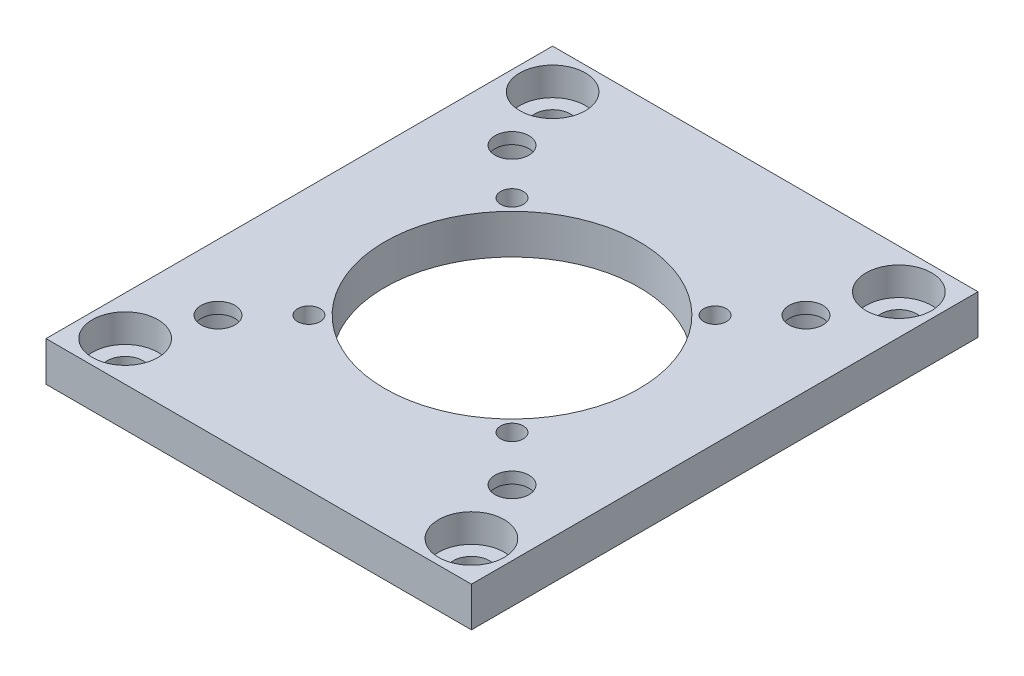
ISO-10303-21;
HEADER;
FILE_DESCRIPTION(('STEP AP214'),'2;1');
FILE_NAME('part.step','',(''),(''),'','','');
FILE_SCHEMA(('AUTOMOTIVE_DESIGN { 1 0 10303 214 1 1 1 1 }'));
ENDSEC;
DATA;
#1=APPLICATION_CONTEXT('core data for automotive mechanical design processes');
#2=APPLICATION_PROTOCOL_DEFINITION('international standard','automotive_design',2000,#1);
#3=PRODUCT_CONTEXT('',#1,'mechanical');
#4=PRODUCT('Part','Part','',(#3));
#5=PRODUCT_RELATED_PRODUCT_CATEGORY('part','',(#4));
#6=PRODUCT_DEFINITION_FORMATION('','',#4);
#7=PRODUCT_DEFINITION_CONTEXT('part definition',#1,'design');
#8=PRODUCT_DEFINITION('design','',#6,#7);
#9=PRODUCT_DEFINITION_SHAPE('','',#8);
#10=(LENGTH_UNIT() NAMED_UNIT(*) SI_UNIT(.MILLI.,.METRE.));
#11=(NAMED_UNIT(*) PLANE_ANGLE_UNIT() SI_UNIT($,.RADIAN.));
#12=(NAMED_UNIT(*) SI_UNIT($,.STERADIAN.) SOLID_ANGLE_UNIT());
#13=UNCERTAINTY_MEASURE_WITH_UNIT(LENGTH_MEASURE(1.E-05),#10,'distance_accuracy_value','');
#14=(GEOMETRIC_REPRESENTATION_CONTEXT(3) GLOBAL_UNCERTAINTY_ASSIGNED_CONTEXT((#13)) GLOBAL_UNIT_ASSIGNED_CONTEXT((#10,
#11,#12)) REPRESENTATION_CONTEXT('',''));
#15=CARTESIAN_POINT('',(0.,0.,0.));
#16=DIRECTION('',(0.,0.,1.));
#17=DIRECTION('',(1.,0.,0.));
#18=AXIS2_PLACEMENT_3D('',#15,#16,#17);
#19=CARTESIAN_POINT('',(0.,3.5,0.));
#20=DIRECTION('',(0.,-1.,0.));
#21=DIRECTION('',(0.,0.,-1.));
#22=AXIS2_PLACEMENT_3D('',#19,#20,#21);
#23=PLANE('',#22);
#24=CARTESIAN_POINT('',(-15.31,3.5,18.9));
#25=DIRECTION('',(0.,1.,0.));
#26=DIRECTION('',(0.,0.,1.));
#27=AXIS2_PLACEMENT_3D('',#24,#25,#26);
#28=CIRCLE('',#27,2.9);
#29=CARTESIAN_POINT('',(-15.31,3.5,21.8));
#30=VERTEX_POINT('',#29);
#31=EDGE_CURVE('E513',#30,#30,#28,.F.);
#32=ORIENTED_EDGE('',*,*,#31,.T.);
#33=EDGE_LOOP('',(#32));
#34=FACE_BOUND('',#33,.T.);
#35=CARTESIAN_POINT('',(15.31,3.5,18.9));
#36=DIRECTION('',(0.,1.,0.));
#37=DIRECTION('',(0.,0.,1.));
#38=AXIS2_PLACEMENT_3D('',#35,#36,#37);
#39=CIRCLE('',#38,2.9);
#40=CARTESIAN_POINT('',(15.31,3.5,21.8));
#41=VERTEX_POINT('',#40);
#42=EDGE_CURVE('E490',#41,#41,#39,.T.);
#43=ORIENTED_EDGE('',*,*,#42,.F.);
#44=EDGE_LOOP('',(#43));
#45=FACE_BOUND('',#44,.T.);
#46=DIRECTION('',(0.,0.,-1.));
#47=VECTOR('',#46,1.);
#48=CARTESIAN_POINT('',(18.8109297462924,3.5,22.4));
#49=LINE('',#48,#47);
#50=CARTESIAN_POINT('',(18.8109297462924,3.5,22.4));
#51=VERTEX_POINT('',#50);
#52=CARTESIAN_POINT('',(18.8109297462924,3.5,-22.4));
#53=VERTEX_POINT('',#52);
#54=EDGE_CURVE('E86',#51,#53,#49,.T.);
#55=ORIENTED_EDGE('',*,*,#54,.T.);
#56=DIRECTION('',(-1.,0.,0.));
#57=VECTOR('',#56,1.);
#58=CARTESIAN_POINT('',(-18.8109297462924,3.5,-22.4));
#59=LINE('',#58,#57);
#60=CARTESIAN_POINT('',(-18.8109297462924,3.5,-22.4));
#61=VERTEX_POINT('',#60);
#62=EDGE_CURVE('E81',#53,#61,#59,.T.);
#63=ORIENTED_EDGE('',*,*,#62,.T.);
#64=DIRECTION('',(0.,0.,1.));
#65=VECTOR('',#64,1.);
#66=CARTESIAN_POINT('',(-18.8109297462924,3.5,-22.4));
#67=LINE('',#66,#65);
#68=CARTESIAN_POINT('',(-18.8109297462924,3.5,22.4));
#69=VERTEX_POINT('',#68);
#70=EDGE_CURVE('E84',#61,#69,#67,.T.);
#71=ORIENTED_EDGE('',*,*,#70,.T.);
#72=DIRECTION('',(1.,0.,0.));
#73=VECTOR('',#72,1.);
#74=CARTESIAN_POINT('',(-18.8109297462924,3.5,22.4));
#75=LINE('',#74,#73);
#76=EDGE_CURVE('E51',#69,#51,#75,.T.);
#77=ORIENTED_EDGE('',*,*,#76,.T.);
#78=EDGE_LOOP('',(#55,#63,#71,#77));
#79=FACE_BOUND('',#78,.T.);
#80=CARTESIAN_POINT('',(0.,3.5,0.));
#81=DIRECTION('',(0.,1.,0.));
#82=DIRECTION('',(0.,0.,1.));
#83=AXIS2_PLACEMENT_3D('',#80,#81,#82);
#84=CIRCLE('',#83,11.25);
#85=CARTESIAN_POINT('',(0.,3.5,11.25));
#86=VERTEX_POINT('',#85);
#87=EDGE_CURVE('E102',#86,#86,#84,.T.);
#88=ORIENTED_EDGE('',*,*,#87,.F.);
#89=EDGE_LOOP('',(#88));
#90=FACE_BOUND('',#89,.T.);
#91=CARTESIAN_POINT('',(-12.9999999999996,3.5,-12.9999999999996));
#92=DIRECTION('',(0.,1.,0.));
#93=DIRECTION('',(0.,0.,1.));
#94=AXIS2_PLACEMENT_3D('',#91,#92,#93);
#95=CIRCLE('',#94,1.5);
#96=CARTESIAN_POINT('',(-12.9999999999996,3.5,-11.4999999999996));
#97=VERTEX_POINT('',#96);
#98=EDGE_CURVE('E176',#97,#97,#95,.T.);
#99=ORIENTED_EDGE('',*,*,#98,.F.);
#100=EDGE_LOOP('',(#99));
#101=FACE_BOUND('',#100,.T.);
#102=CARTESIAN_POINT('',(12.9999999999996,3.5,-12.9999999999996));
#103=DIRECTION('',(0.,1.,0.));
#104=DIRECTION('',(0.,0.,-1.));
#105=AXIS2_PLACEMENT_3D('',#102,#103,#104);
#106=CIRCLE('',#105,1.5);
#107=CARTESIAN_POINT('',(12.9999999999996,3.5,-14.4999999999996));
#108=VERTEX_POINT('',#107);
#109=EDGE_CURVE('E173',#108,#108,#106,.T.);
#110=ORIENTED_EDGE('',*,*,#109,.F.);
#111=EDGE_LOOP('',(#110));
#112=FACE_BOUND('',#111,.T.);
#113=CARTESIAN_POINT('',(12.9999999999996,3.5,12.9999999999996));
#114=DIRECTION('',(0.,1.,0.));
#115=DIRECTION('',(0.,0.,1.));
#116=AXIS2_PLACEMENT_3D('',#113,#114,#115);
#117=CIRCLE('',#116,1.5);
#118=CARTESIAN_POINT('',(12.9999999999996,3.5,14.4999999999996));
#119=VERTEX_POINT('',#118);
#120=EDGE_CURVE('E170',#119,#119,#117,.T.);
#121=ORIENTED_EDGE('',*,*,#120,.F.);
#122=EDGE_LOOP('',(#121));
#123=FACE_BOUND('',#122,.T.);
#124=CARTESIAN_POINT('',(-12.9999999999996,3.5,12.9999999999996));
#125=DIRECTION('',(0.,1.,0.));
#126=DIRECTION('',(0.,0.,-1.));
#127=AXIS2_PLACEMENT_3D('',#124,#125,#126);
#128=CIRCLE('',#127,1.5);
#129=CARTESIAN_POINT('',(-12.9999999999996,3.5,11.4999999999996));
#130=VERTEX_POINT('',#129);
#131=EDGE_CURVE('E165',#130,#130,#128,.T.);
#132=ORIENTED_EDGE('',*,*,#131,.F.);
#133=EDGE_LOOP('',(#132));
#134=FACE_BOUND('',#133,.T.);
#135=CARTESIAN_POINT('',(8.9799999999985,3.5,-8.98000000000025));
#136=DIRECTION('',(0.,1.,0.));
#137=DIRECTION('',(0.,0.,1.));
#138=AXIS2_PLACEMENT_3D('',#135,#136,#137);
#139=CIRCLE('',#138,1.00000000000132);
#140=CARTESIAN_POINT('',(8.9799999999985,3.5,-7.97999999999893));
#141=VERTEX_POINT('',#140);
#142=EDGE_CURVE('E162',#141,#141,#139,.T.);
#143=ORIENTED_EDGE('',*,*,#142,.F.);
#144=EDGE_LOOP('',(#143));
#145=FACE_BOUND('',#144,.T.);
#146=CARTESIAN_POINT('',(-8.9799999999985,3.5,-8.98000000000024));
#147=DIRECTION('',(0.,1.,0.));
#148=DIRECTION('',(0.,0.,-1.));
#149=AXIS2_PLACEMENT_3D('',#146,#147,#148);
#150=CIRCLE('',#149,1.00000000000132);
#151=CARTESIAN_POINT('',(-8.9799999999985,3.5,-9.98000000000156));
#152=VERTEX_POINT('',#151);
#153=EDGE_CURVE('E156',#152,#152,#150,.T.);
#154=ORIENTED_EDGE('',*,*,#153,.F.);
#155=EDGE_LOOP('',(#154));
#156=FACE_BOUND('',#155,.T.);
#157=CARTESIAN_POINT('',(8.9799999999985,3.5,8.98000000000025));
#158=DIRECTION('',(0.,1.,0.));
#159=DIRECTION('',(0.,0.,-1.));
#160=AXIS2_PLACEMENT_3D('',#157,#158,#159);
#161=CIRCLE('',#160,1.00000000000132);
#162=CARTESIAN_POINT('',(8.9799999999985,3.5,7.97999999999893));
#163=VERTEX_POINT('',#162);
#164=EDGE_CURVE('E150',#163,#163,#161,.T.);
#165=ORIENTED_EDGE('',*,*,#164,.F.);
#166=EDGE_LOOP('',(#165));
#167=FACE_BOUND('',#166,.T.);
#168=CARTESIAN_POINT('',(-8.9799999999985,3.5,8.98000000000024));
#169=DIRECTION('',(0.,1.,0.));
#170=DIRECTION('',(0.,0.,1.));
#171=AXIS2_PLACEMENT_3D('',#168,#169,#170);
#172=CIRCLE('',#171,1.00000000000132);
#173=CARTESIAN_POINT('',(-8.9799999999985,3.5,9.98000000000156));
#174=VERTEX_POINT('',#173);
#175=EDGE_CURVE('E144',#174,#174,#172,.T.);
#176=ORIENTED_EDGE('',*,*,#175,.F.);
#177=EDGE_LOOP('',(#176));
#178=FACE_BOUND('',#177,.T.);
#179=CARTESIAN_POINT('',(-15.31,3.5,-18.9));
#180=DIRECTION('',(0.,1.,0.));
#181=DIRECTION('',(0.,0.,1.));
#182=AXIS2_PLACEMENT_3D('',#179,#180,#181);
#183=CIRCLE('',#182,2.9);
#184=CARTESIAN_POINT('',(-15.31,3.5,-16.));
#185=VERTEX_POINT('',#184);
#186=EDGE_CURVE('E504',#185,#185,#183,.T.);
#187=ORIENTED_EDGE('',*,*,#186,.F.);
#188=EDGE_LOOP('',(#187));
#189=FACE_BOUND('',#188,.T.);
#190=CARTESIAN_POINT('',(15.3099989809404,3.5,-18.9000023370333));
#191=DIRECTION('',(0.,1.,0.));
#192=DIRECTION('',(0.,0.,1.));
#193=AXIS2_PLACEMENT_3D('',#190,#191,#192);
#194=CIRCLE('',#193,2.9);
#195=CARTESIAN_POINT('',(15.3099989809404,3.5,-16.0000023370333));
#196=VERTEX_POINT('',#195);
#197=EDGE_CURVE('E495',#196,#196,#194,.F.);
#198=ORIENTED_EDGE('',*,*,#197,.T.);
#199=EDGE_LOOP('',(#198));
#200=FACE_BOUND('',#199,.T.);
#201=ADVANCED_FACE('F32',(#34,#45,#79,#90,#101,#112,#123,#134,#145,#156,#167,#178,#189,#200),
#23,.F.);
#202=CARTESIAN_POINT('',(-15.31,3.5,-18.9));
#203=DIRECTION('',(0.,-1.,0.));
#204=DIRECTION('',(0.,0.,-1.));
#205=AXIS2_PLACEMENT_3D('',#202,#203,#204);
#206=CYLINDRICAL_SURFACE('',#205,1.6);
#207=CARTESIAN_POINT('',(-15.31,0.,-18.9));
#208=DIRECTION('',(0.,1.,0.));
#209=DIRECTION('',(0.,0.,1.));
#210=AXIS2_PLACEMENT_3D('',#207,#208,#209);
#211=CIRCLE('',#210,1.6);
#212=CARTESIAN_POINT('',(-15.31,0.,-17.3));
#213=VERTEX_POINT('',#212);
#214=EDGE_CURVE('E140',#213,#213,#211,.T.);
#215=ORIENTED_EDGE('',*,*,#214,.F.);
#216=EDGE_LOOP('',(#215));
#217=FACE_BOUND('',#216,.T.);
#218=CARTESIAN_POINT('',(-15.31,1.,-18.9));
#219=DIRECTION('',(0.,1.,0.));
#220=DIRECTION('',(0.,0.,1.));
#221=AXIS2_PLACEMENT_3D('',#218,#219,#220);
#222=CIRCLE('',#221,1.6);
#223=CARTESIAN_POINT('',(-15.31,1.,-17.3));
#224=VERTEX_POINT('',#223);
#225=EDGE_CURVE('E501',#224,#224,#222,.F.);
#226=ORIENTED_EDGE('',*,*,#225,.F.);
#227=EDGE_LOOP('',(#226));
#228=FACE_BOUND('',#227,.T.);
#229=ADVANCED_FACE('F205',(#217,#228),#206,.F.);
#230=CARTESIAN_POINT('',(15.31,3.5,-18.9));
#231=DIRECTION('',(0.,-1.,0.));
#232=DIRECTION('',(0.,0.,-1.));
#233=AXIS2_PLACEMENT_3D('',#230,#231,#232);
#234=CYLINDRICAL_SURFACE('',#233,1.6);
#235=CARTESIAN_POINT('',(15.31,0.,-18.9));
#236=DIRECTION('',(0.,1.,0.));
#237=DIRECTION('',(0.,0.,-1.));
#238=AXIS2_PLACEMENT_3D('',#235,#236,#237);
#239=CIRCLE('',#238,1.6);
#240=CARTESIAN_POINT('',(15.31,0.,-20.5));
#241=VERTEX_POINT('',#240);
#242=EDGE_CURVE('E137',#241,#241,#239,.T.);
#243=ORIENTED_EDGE('',*,*,#242,.F.);
#244=EDGE_LOOP('',(#243));
#245=FACE_BOUND('',#244,.T.);
#246=CARTESIAN_POINT('',(15.31,1.,-18.9));
#247=DIRECTION('',(0.,1.,0.));
#248=DIRECTION('',(0.,0.,1.));
#249=AXIS2_PLACEMENT_3D('',#246,#247,#248);
#250=CIRCLE('',#249,1.6);
#251=CARTESIAN_POINT('',(15.31,1.,-17.3));
#252=VERTEX_POINT('',#251);
#253=EDGE_CURVE('E488',#252,#252,#250,.F.);
#254=ORIENTED_EDGE('',*,*,#253,.F.);
#255=EDGE_LOOP('',(#254));
#256=FACE_BOUND('',#255,.T.);
#257=ADVANCED_FACE('F210',(#245,#256),#234,.F.);
#258=CARTESIAN_POINT('',(-15.31,3.5,18.9));
#259=DIRECTION('',(0.,-1.,0.));
#260=DIRECTION('',(0.,0.,-1.));
#261=AXIS2_PLACEMENT_3D('',#258,#259,#260);
#262=CYLINDRICAL_SURFACE('',#261,1.6);
#263=CARTESIAN_POINT('',(-15.31,0.,18.9));
#264=DIRECTION('',(0.,1.,0.));
#265=DIRECTION('',(0.,0.,-1.));
#266=AXIS2_PLACEMENT_3D('',#263,#264,#265);
#267=CIRCLE('',#266,1.6);
#268=CARTESIAN_POINT('',(-15.31,0.,17.3));
#269=VERTEX_POINT('',#268);
#270=EDGE_CURVE('E111',#269,#269,#267,.T.);
#271=ORIENTED_EDGE('',*,*,#270,.F.);
#272=EDGE_LOOP('',(#271));
#273=FACE_BOUND('',#272,.T.);
#274=CARTESIAN_POINT('',(-15.31,1.,18.9));
#275=DIRECTION('',(0.,1.,0.));
#276=DIRECTION('',(0.,0.,1.));
#277=AXIS2_PLACEMENT_3D('',#274,#275,#276);
#278=CIRCLE('',#277,1.6);
#279=CARTESIAN_POINT('',(-15.31,1.,20.5));
#280=VERTEX_POINT('',#279);
#281=EDGE_CURVE('E509',#280,#280,#278,.F.);
#282=ORIENTED_EDGE('',*,*,#281,.F.);
#283=EDGE_LOOP('',(#282));
#284=FACE_BOUND('',#283,.T.);
#285=ADVANCED_FACE('F257',(#273,#284),#262,.F.);
#286=CARTESIAN_POINT('',(15.31,3.5,18.9));
#287=DIRECTION('',(0.,-1.,0.));
#288=DIRECTION('',(0.,0.,-1.));
#289=AXIS2_PLACEMENT_3D('',#286,#287,#288);
#290=CYLINDRICAL_SURFACE('',#289,1.6);
#291=CARTESIAN_POINT('',(15.31,0.,18.9));
#292=DIRECTION('',(0.,1.,0.));
#293=DIRECTION('',(0.,0.,1.));
#294=AXIS2_PLACEMENT_3D('',#291,#292,#293);
#295=CIRCLE('',#294,1.6);
#296=CARTESIAN_POINT('',(15.31,0.,20.5));
#297=VERTEX_POINT('',#296);
#298=EDGE_CURVE('E134',#297,#297,#295,.T.);
#299=ORIENTED_EDGE('',*,*,#298,.F.);
#300=EDGE_LOOP('',(#299));
#301=FACE_BOUND('',#300,.T.);
#302=CARTESIAN_POINT('',(15.31,1.,18.9));
#303=DIRECTION('',(0.,1.,0.));
#304=DIRECTION('',(0.,0.,1.));
#305=AXIS2_PLACEMENT_3D('',#302,#303,#304);
#306=CIRCLE('',#305,1.6);
#307=CARTESIAN_POINT('',(15.31,1.,20.5));
#308=VERTEX_POINT('',#307);
#309=EDGE_CURVE('E493',#308,#308,#306,.F.);
#310=ORIENTED_EDGE('',*,*,#309,.F.);
#311=EDGE_LOOP('',(#310));
#312=FACE_BOUND('',#311,.T.);
#313=ADVANCED_FACE('F248',(#301,#312),#290,.F.);
#314=CARTESIAN_POINT('',(12.9999999999996,3.5,12.9999999999996));
#315=DIRECTION('',(0.,-1.,0.));
#316=DIRECTION('',(0.,0.,-1.));
#317=AXIS2_PLACEMENT_3D('',#314,#315,#316);
#318=CYLINDRICAL_SURFACE('',#317,1.5);
#319=ORIENTED_EDGE('',*,*,#120,.T.);
#320=EDGE_LOOP('',(#319));
#321=FACE_BOUND('',#320,.T.);
#322=CARTESIAN_POINT('',(12.9999999999996,2.5,12.9999999999996));
#323=DIRECTION('',(0.,-1.,0.));
#324=DIRECTION('',(0.,0.,-1.));
#325=AXIS2_PLACEMENT_3D('',#322,#323,#324);
#326=CIRCLE('',#325,1.5);
#327=CARTESIAN_POINT('',(12.9999999999996,2.5,11.4999999999996));
#328=VERTEX_POINT('',#327);
#329=EDGE_CURVE('E115',#328,#328,#326,.T.);
#330=ORIENTED_EDGE('',*,*,#329,.T.);
#331=EDGE_LOOP('',(#330));
#332=FACE_BOUND('',#331,.T.);
#333=ADVANCED_FACE('F241',(#321,#332),#318,.F.);
#334=CARTESIAN_POINT('',(-12.9999999999996,3.5,-12.9999999999996));
#335=DIRECTION('',(0.,-1.,0.));
#336=DIRECTION('',(0.,0.,-1.));
#337=AXIS2_PLACEMENT_3D('',#334,#335,#336);
#338=CYLINDRICAL_SURFACE('',#337,1.5);
#339=ORIENTED_EDGE('',*,*,#98,.T.);
#340=EDGE_LOOP('',(#339));
#341=FACE_BOUND('',#340,.T.);
#342=CARTESIAN_POINT('',(-12.9999999999996,2.5,-12.9999999999996));
#343=DIRECTION('',(0.,-1.,0.));
#344=DIRECTION('',(0.,0.,-1.));
#345=AXIS2_PLACEMENT_3D('',#342,#343,#344);
#346=CIRCLE('',#345,1.5);
#347=CARTESIAN_POINT('',(-12.9999999999996,2.5,-14.4999999999996));
#348=VERTEX_POINT('',#347);
#349=EDGE_CURVE('E108',#348,#348,#346,.T.);
#350=ORIENTED_EDGE('',*,*,#349,.T.);
#351=EDGE_LOOP('',(#350));
#352=FACE_BOUND('',#351,.T.);
#353=ADVANCED_FACE('F217',(#341,#352),#338,.F.);
#354=CARTESIAN_POINT('',(0.,0.,0.));
#355=DIRECTION('',(0.,-1.,0.));
#356=DIRECTION('',(0.,0.,-1.));
#357=AXIS2_PLACEMENT_3D('',#354,#355,#356);
#358=PLANE('',#357);
#359=CARTESIAN_POINT('',(12.9999999999996,0.,-12.9999999999996));
#360=DIRECTION('',(0.,-1.,0.));
#361=DIRECTION('',(0.,0.,1.));
#362=AXIS2_PLACEMENT_3D('',#359,#360,#361);
#363=CIRCLE('',#362,2.9);
#364=CARTESIAN_POINT('',(12.9999999999996,0.,-10.0999999999996));
#365=VERTEX_POINT('',#364);
#366=EDGE_CURVE('E525',#365,#365,#363,.T.);
#367=ORIENTED_EDGE('',*,*,#366,.F.);
#368=EDGE_LOOP('',(#367));
#369=FACE_BOUND('',#368,.T.);
#370=CARTESIAN_POINT('',(12.9999999999996,0.,12.9999999999996));
#371=DIRECTION('',(0.,-1.,0.));
#372=DIRECTION('',(0.,0.,-1.));
#373=AXIS2_PLACEMENT_3D('',#370,#371,#372);
#374=CIRCLE('',#373,2.9);
#375=CARTESIAN_POINT('',(12.9999999999996,0.,10.0999999999996));
#376=VERTEX_POINT('',#375);
#377=EDGE_CURVE('E531',#376,#376,#374,.T.);
#378=ORIENTED_EDGE('',*,*,#377,.F.);
#379=EDGE_LOOP('',(#378));
#380=FACE_BOUND('',#379,.T.);
#381=CARTESIAN_POINT('',(-12.9999999999996,0.,12.9999999999996));
#382=DIRECTION('',(0.,-1.,0.));
#383=DIRECTION('',(0.,0.,1.));
#384=AXIS2_PLACEMENT_3D('',#381,#382,#383);
#385=CIRCLE('',#384,2.9);
#386=CARTESIAN_POINT('',(-12.9999999999996,0.,15.8999999999996));
#387=VERTEX_POINT('',#386);
#388=EDGE_CURVE('E521',#387,#387,#385,.T.);
#389=ORIENTED_EDGE('',*,*,#388,.F.);
#390=EDGE_LOOP('',(#389));
#391=FACE_BOUND('',#390,.T.);
#392=CARTESIAN_POINT('',(-12.9999999999996,0.,-12.9999999999996));
#393=DIRECTION('',(0.,-1.,0.));
#394=DIRECTION('',(0.,0.,-1.));
#395=AXIS2_PLACEMENT_3D('',#392,#393,#394);
#396=CIRCLE('',#395,2.9);
#397=CARTESIAN_POINT('',(-12.9999999999996,0.,-15.8999999999996));
#398=VERTEX_POINT('',#397);
#399=EDGE_CURVE('E121',#398,#398,#396,.T.);
#400=ORIENTED_EDGE('',*,*,#399,.F.);
#401=EDGE_LOOP('',(#400));
#402=FACE_BOUND('',#401,.T.);
#403=ORIENTED_EDGE('',*,*,#298,.T.);
#404=EDGE_LOOP('',(#403));
#405=FACE_BOUND('',#404,.T.);
#406=ORIENTED_EDGE('',*,*,#214,.T.);
#407=EDGE_LOOP('',(#406));
#408=FACE_BOUND('',#407,.T.);
#409=CARTESIAN_POINT('',(8.9799999999985,0.,8.98000000000025));
#410=DIRECTION('',(0.,1.,0.));
#411=DIRECTION('',(0.,0.,-1.));
#412=AXIS2_PLACEMENT_3D('',#409,#410,#411);
#413=CIRCLE('',#412,1.00000000000132);
#414=CARTESIAN_POINT('',(8.9799999999985,0.,7.97999999999893));
#415=VERTEX_POINT('',#414);
#416=EDGE_CURVE('E147',#415,#415,#413,.T.);
#417=ORIENTED_EDGE('',*,*,#416,.T.);
#418=EDGE_LOOP('',(#417));
#419=FACE_BOUND('',#418,.T.);
#420=CARTESIAN_POINT('',(8.9799999999985,0.,-8.98000000000025));
#421=DIRECTION('',(0.,1.,0.));
#422=DIRECTION('',(0.,0.,1.));
#423=AXIS2_PLACEMENT_3D('',#420,#421,#422);
#424=CIRCLE('',#423,1.00000000000132);
#425=CARTESIAN_POINT('',(8.9799999999985,0.,-7.97999999999893));
#426=VERTEX_POINT('',#425);
#427=EDGE_CURVE('E159',#426,#426,#424,.T.);
#428=ORIENTED_EDGE('',*,*,#427,.T.);
#429=EDGE_LOOP('',(#428));
#430=FACE_BOUND('',#429,.T.);
#431=DIRECTION('',(0.,0.,-1.));
#432=VECTOR('',#431,1.);
#433=CARTESIAN_POINT('',(18.8109297462924,0.,22.4));
#434=LINE('',#433,#432);
#435=CARTESIAN_POINT('',(18.8109297462924,0.,22.4));
#436=VERTEX_POINT('',#435);
#437=CARTESIAN_POINT('',(18.8109297462924,0.,-22.4));
#438=VERTEX_POINT('',#437);
#439=EDGE_CURVE('E99',#436,#438,#434,.T.);
#440=ORIENTED_EDGE('',*,*,#439,.F.);
#441=DIRECTION('',(1.,0.,0.));
#442=VECTOR('',#441,1.);
#443=CARTESIAN_POINT('',(-18.8109297462924,0.,22.4));
#444=LINE('',#443,#442);
#445=CARTESIAN_POINT('',(-18.8109297462924,0.,22.4));
#446=VERTEX_POINT('',#445);
#447=EDGE_CURVE('E74',#446,#436,#444,.T.);
#448=ORIENTED_EDGE('',*,*,#447,.F.);
#449=DIRECTION('',(0.,0.,1.));
#450=VECTOR('',#449,1.);
#451=CARTESIAN_POINT('',(-18.8109297462924,0.,-22.4));
#452=LINE('',#451,#450);
#453=CARTESIAN_POINT('',(-18.8109297462924,0.,-22.4));
#454=VERTEX_POINT('',#453);
#455=EDGE_CURVE('E68',#454,#446,#452,.T.);
#456=ORIENTED_EDGE('',*,*,#455,.F.);
#457=DIRECTION('',(-1.,0.,0.));
#458=VECTOR('',#457,1.);
#459=CARTESIAN_POINT('',(-18.8109297462924,0.,-22.4));
#460=LINE('',#459,#458);
#461=EDGE_CURVE('E90',#438,#454,#460,.T.);
#462=ORIENTED_EDGE('',*,*,#461,.F.);
#463=EDGE_LOOP('',(#440,#448,#456,#462));
#464=FACE_BOUND('',#463,.T.);
#465=CARTESIAN_POINT('',(0.,0.,0.));
#466=DIRECTION('',(0.,1.,0.));
#467=DIRECTION('',(0.,0.,1.));
#468=AXIS2_PLACEMENT_3D('',#465,#466,#467);
#469=CIRCLE('',#468,11.25);
#470=CARTESIAN_POINT('',(0.,0.,11.25));
#471=VERTEX_POINT('',#470);
#472=EDGE_CURVE('E179',#471,#471,#469,.T.);
#473=ORIENTED_EDGE('',*,*,#472,.T.);
#474=EDGE_LOOP('',(#473));
#475=FACE_BOUND('',#474,.T.);
#476=CARTESIAN_POINT('',(-8.9799999999985,0.,-8.98000000000024));
#477=DIRECTION('',(0.,1.,0.));
#478=DIRECTION('',(0.,0.,-1.));
#479=AXIS2_PLACEMENT_3D('',#476,#477,#478);
#480=CIRCLE('',#479,1.00000000000132);
#481=CARTESIAN_POINT('',(-8.9799999999985,0.,-9.98000000000156));
#482=VERTEX_POINT('',#481);
#483=EDGE_CURVE('E153',#482,#482,#480,.T.);
#484=ORIENTED_EDGE('',*,*,#483,.T.);
#485=EDGE_LOOP('',(#484));
#486=FACE_BOUND('',#485,.T.);
#487=CARTESIAN_POINT('',(-8.9799999999985,0.,8.98000000000024));
#488=DIRECTION('',(0.,1.,0.));
#489=DIRECTION('',(0.,0.,1.));
#490=AXIS2_PLACEMENT_3D('',#487,#488,#489);
#491=CIRCLE('',#490,1.00000000000132);
#492=CARTESIAN_POINT('',(-8.9799999999985,0.,9.98000000000156));
#493=VERTEX_POINT('',#492);
#494=EDGE_CURVE('E143',#493,#493,#491,.T.);
#495=ORIENTED_EDGE('',*,*,#494,.T.);
#496=EDGE_LOOP('',(#495));
#497=FACE_BOUND('',#496,.T.);
#498=ORIENTED_EDGE('',*,*,#242,.T.);
#499=EDGE_LOOP('',(#498));
#500=FACE_BOUND('',#499,.T.);
#501=ORIENTED_EDGE('',*,*,#270,.T.);
#502=EDGE_LOOP('',(#501));
#503=FACE_BOUND('',#502,.T.);
#504=ADVANCED_FACE('F185',(#369,#380,#391,#402,#405,#408,#419,#430,#464,#475,#486,#497,#500,
#503),#358,.T.);
#505=CARTESIAN_POINT('',(18.8109297462924,3.5,22.4));
#506=DIRECTION('',(-1.,0.,0.));
#507=DIRECTION('',(0.,0.,1.));
#508=AXIS2_PLACEMENT_3D('',#505,#506,#507);
#509=PLANE('',#508);
#510=ORIENTED_EDGE('',*,*,#439,.T.);
#511=DIRECTION('',(0.,-1.,0.));
#512=VECTOR('',#511,1.);
#513=CARTESIAN_POINT('',(18.8109297462924,3.5,-22.4));
#514=LINE('',#513,#512);
#515=EDGE_CURVE('E11',#53,#438,#514,.T.);
#516=ORIENTED_EDGE('',*,*,#515,.F.);
#517=ORIENTED_EDGE('',*,*,#54,.F.);
#518=DIRECTION('',(0.,-1.,0.));
#519=VECTOR('',#518,1.);
#520=CARTESIAN_POINT('',(18.8109297462924,3.5,22.4));
#521=LINE('',#520,#519);
#522=EDGE_CURVE('E95',#51,#436,#521,.T.);
#523=ORIENTED_EDGE('',*,*,#522,.T.);
#524=EDGE_LOOP('',(#510,#516,#517,#523));
#525=FACE_BOUND('',#524,.T.);
#526=ADVANCED_FACE('F34',(#525),#509,.F.);
#527=CARTESIAN_POINT('',(-18.8109297462924,3.5,-22.4));
#528=DIRECTION('',(0.,0.,1.));
#529=DIRECTION('',(1.,0.,0.));
#530=AXIS2_PLACEMENT_3D('',#527,#528,#529);
#531=PLANE('',#530);
#532=ORIENTED_EDGE('',*,*,#461,.T.);
#533=DIRECTION('',(0.,-1.,0.));
#534=VECTOR('',#533,1.);
#535=CARTESIAN_POINT('',(-18.8109297462924,3.5,-22.4));
#536=LINE('',#535,#534);
#537=EDGE_CURVE('E42',#61,#454,#536,.T.);
#538=ORIENTED_EDGE('',*,*,#537,.F.);
#539=ORIENTED_EDGE('',*,*,#62,.F.);
#540=ORIENTED_EDGE('',*,*,#515,.T.);
#541=EDGE_LOOP('',(#532,#538,#539,#540));
#542=FACE_BOUND('',#541,.T.);
#543=ADVANCED_FACE('F89',(#542),#531,.F.);
#544=CARTESIAN_POINT('',(-18.8109297462924,3.5,-22.4));
#545=DIRECTION('',(1.,0.,0.));
#546=DIRECTION('',(0.,0.,-1.));
#547=AXIS2_PLACEMENT_3D('',#544,#545,#546);
#548=PLANE('',#547);
#549=ORIENTED_EDGE('',*,*,#455,.T.);
#550=DIRECTION('',(0.,-1.,0.));
#551=VECTOR('',#550,1.);
#552=CARTESIAN_POINT('',(-18.8109297462924,3.5,22.4));
#553=LINE('',#552,#551);
#554=EDGE_CURVE('E91',#69,#446,#553,.T.);
#555=ORIENTED_EDGE('',*,*,#554,.F.);
#556=ORIENTED_EDGE('',*,*,#70,.F.);
#557=ORIENTED_EDGE('',*,*,#537,.T.);
#558=EDGE_LOOP('',(#549,#555,#556,#557));
#559=FACE_BOUND('',#558,.T.);
#560=ADVANCED_FACE('F93',(#559),#548,.F.);
#561=CARTESIAN_POINT('',(-18.8109297462924,3.5,22.4));
#562=DIRECTION('',(0.,0.,-1.));
#563=DIRECTION('',(-1.,0.,0.));
#564=AXIS2_PLACEMENT_3D('',#561,#562,#563);
#565=PLANE('',#564);
#566=ORIENTED_EDGE('',*,*,#447,.T.);
#567=ORIENTED_EDGE('',*,*,#522,.F.);
#568=ORIENTED_EDGE('',*,*,#76,.F.);
#569=ORIENTED_EDGE('',*,*,#554,.T.);
#570=EDGE_LOOP('',(#566,#567,#568,#569));
#571=FACE_BOUND('',#570,.T.);
#572=ADVANCED_FACE('F191',(#571),#565,.F.);
#573=CARTESIAN_POINT('',(0.,3.5,0.));
#574=DIRECTION('',(0.,-1.,0.));
#575=DIRECTION('',(0.,0.,-1.));
#576=AXIS2_PLACEMENT_3D('',#573,#574,#575);
#577=CYLINDRICAL_SURFACE('',#576,11.25);
#578=ORIENTED_EDGE('',*,*,#87,.T.);
#579=EDGE_LOOP('',(#578));
#580=FACE_BOUND('',#579,.T.);
#581=ORIENTED_EDGE('',*,*,#472,.F.);
#582=EDGE_LOOP('',(#581));
#583=FACE_BOUND('',#582,.T.);
#584=ADVANCED_FACE('F188',(#580,#583),#577,.F.);
#585=CARTESIAN_POINT('',(12.9999999999996,3.5,-12.9999999999996));
#586=DIRECTION('',(0.,-1.,0.));
#587=DIRECTION('',(0.,0.,-1.));
#588=AXIS2_PLACEMENT_3D('',#585,#586,#587);
#589=CYLINDRICAL_SURFACE('',#588,1.5);
#590=CARTESIAN_POINT('',(12.9999999999996,2.5,-12.9999999999996));
#591=DIRECTION('',(0.,1.,0.));
#592=DIRECTION('',(0.,0.,1.));
#593=AXIS2_PLACEMENT_3D('',#590,#591,#592);
#594=CIRCLE('',#593,1.5);
#595=CARTESIAN_POINT('',(12.9999999999996,2.5,-11.4999999999996));
#596=VERTEX_POINT('',#595);
#597=EDGE_CURVE('E36',#596,#596,#594,.T.);
#598=ORIENTED_EDGE('',*,*,#597,.F.);
#599=EDGE_LOOP('',(#598));
#600=FACE_BOUND('',#599,.T.);
#601=ORIENTED_EDGE('',*,*,#109,.T.);
#602=EDGE_LOOP('',(#601));
#603=FACE_BOUND('',#602,.T.);
#604=ADVANCED_FACE('F190',(#600,#603),#589,.F.);
#605=CARTESIAN_POINT('',(-12.9999999999996,3.5,12.9999999999996));
#606=DIRECTION('',(0.,-1.,0.));
#607=DIRECTION('',(0.,0.,-1.));
#608=AXIS2_PLACEMENT_3D('',#605,#606,#607);
#609=CYLINDRICAL_SURFACE('',#608,1.5);
#610=CARTESIAN_POINT('',(-12.9999999999996,2.5,12.9999999999996));
#611=DIRECTION('',(0.,1.,0.));
#612=DIRECTION('',(0.,0.,1.));
#613=AXIS2_PLACEMENT_3D('',#610,#611,#612);
#614=CIRCLE('',#613,1.5);
#615=CARTESIAN_POINT('',(-12.9999999999996,2.5,14.4999999999996));
#616=VERTEX_POINT('',#615);
#617=EDGE_CURVE('E113',#616,#616,#614,.T.);
#618=ORIENTED_EDGE('',*,*,#617,.F.);
#619=EDGE_LOOP('',(#618));
#620=FACE_BOUND('',#619,.T.);
#621=ORIENTED_EDGE('',*,*,#131,.T.);
#622=EDGE_LOOP('',(#621));
#623=FACE_BOUND('',#622,.T.);
#624=ADVANCED_FACE('F198',(#620,#623),#609,.F.);
#625=CARTESIAN_POINT('',(8.9799999999985,3.5,-8.98000000000025));
#626=DIRECTION('',(0.,-1.,0.));
#627=DIRECTION('',(0.,0.,-1.));
#628=AXIS2_PLACEMENT_3D('',#625,#626,#627);
#629=CYLINDRICAL_SURFACE('',#628,1.00000000000132);
#630=ORIENTED_EDGE('',*,*,#142,.T.);
#631=EDGE_LOOP('',(#630));
#632=FACE_BOUND('',#631,.T.);
#633=ORIENTED_EDGE('',*,*,#427,.F.);
#634=EDGE_LOOP('',(#633));
#635=FACE_BOUND('',#634,.T.);
#636=ADVANCED_FACE('F374',(#632,#635),#629,.F.);
#637=CARTESIAN_POINT('',(-8.9799999999985,3.5,-8.98000000000024));
#638=DIRECTION('',(0.,-1.,0.));
#639=DIRECTION('',(0.,0.,-1.));
#640=AXIS2_PLACEMENT_3D('',#637,#638,#639);
#641=CYLINDRICAL_SURFACE('',#640,1.00000000000132);
#642=ORIENTED_EDGE('',*,*,#153,.T.);
#643=EDGE_LOOP('',(#642));
#644=FACE_BOUND('',#643,.T.);
#645=ORIENTED_EDGE('',*,*,#483,.F.);
#646=EDGE_LOOP('',(#645));
#647=FACE_BOUND('',#646,.T.);
#648=ADVANCED_FACE('F414',(#644,#647),#641,.F.);
#649=CARTESIAN_POINT('',(8.9799999999985,3.5,8.98000000000025));
#650=DIRECTION('',(0.,-1.,0.));
#651=DIRECTION('',(0.,0.,-1.));
#652=AXIS2_PLACEMENT_3D('',#649,#650,#651);
#653=CYLINDRICAL_SURFACE('',#652,1.00000000000132);
#654=ORIENTED_EDGE('',*,*,#164,.T.);
#655=EDGE_LOOP('',(#654));
#656=FACE_BOUND('',#655,.T.);
#657=ORIENTED_EDGE('',*,*,#416,.F.);
#658=EDGE_LOOP('',(#657));
#659=FACE_BOUND('',#658,.T.);
#660=ADVANCED_FACE('F424',(#656,#659),#653,.F.);
#661=CARTESIAN_POINT('',(-8.9799999999985,3.5,8.98000000000024));
#662=DIRECTION('',(0.,-1.,0.));
#663=DIRECTION('',(0.,0.,-1.));
#664=AXIS2_PLACEMENT_3D('',#661,#662,#663);
#665=CYLINDRICAL_SURFACE('',#664,1.00000000000132);
#666=ORIENTED_EDGE('',*,*,#175,.T.);
#667=EDGE_LOOP('',(#666));
#668=FACE_BOUND('',#667,.T.);
#669=ORIENTED_EDGE('',*,*,#494,.F.);
#670=EDGE_LOOP('',(#669));
#671=FACE_BOUND('',#670,.T.);
#672=ADVANCED_FACE('F364',(#668,#671),#665,.F.);
#673=CARTESIAN_POINT('',(-12.9999999999996,2.5,-12.9999999999996));
#674=DIRECTION('',(0.,-1.,0.));
#675=DIRECTION('',(0.,0.,-1.));
#676=AXIS2_PLACEMENT_3D('',#673,#674,#675);
#677=CYLINDRICAL_SURFACE('',#676,2.9);
#678=CARTESIAN_POINT('',(-12.9999999999996,2.5,-12.9999999999996));
#679=DIRECTION('',(0.,-1.,0.));
#680=DIRECTION('',(0.,0.,-1.));
#681=AXIS2_PLACEMENT_3D('',#678,#679,#680);
#682=CIRCLE('',#681,2.9);
#683=CARTESIAN_POINT('',(-12.9999999999996,2.5,-15.8999999999996));
#684=VERTEX_POINT('',#683);
#685=EDGE_CURVE('E112',#684,#684,#682,.T.);
#686=ORIENTED_EDGE('',*,*,#685,.F.);
#687=EDGE_LOOP('',(#686));
#688=FACE_BOUND('',#687,.T.);
#689=ORIENTED_EDGE('',*,*,#399,.T.);
#690=EDGE_LOOP('',(#689));
#691=FACE_BOUND('',#690,.T.);
#692=ADVANCED_FACE('F354',(#688,#691),#677,.F.);
#693=CARTESIAN_POINT('',(-12.9999999999996,2.5,-12.9999999999996));
#694=DIRECTION('',(0.,-1.,0.));
#695=DIRECTION('',(0.,0.,-1.));
#696=AXIS2_PLACEMENT_3D('',#693,#694,#695);
#697=PLANE('',#696);
#698=ORIENTED_EDGE('',*,*,#349,.F.);
#699=EDGE_LOOP('',(#698));
#700=FACE_BOUND('',#699,.T.);
#701=ORIENTED_EDGE('',*,*,#685,.T.);
#702=EDGE_LOOP('',(#701));
#703=FACE_BOUND('',#702,.T.);
#704=ADVANCED_FACE('F344',(#700,#703),#697,.T.);
#705=CARTESIAN_POINT('',(-12.9999999999996,2.5,12.9999999999996));
#706=DIRECTION('',(0.,-1.,0.));
#707=DIRECTION('',(0.,0.,-1.));
#708=AXIS2_PLACEMENT_3D('',#705,#706,#707);
#709=CYLINDRICAL_SURFACE('',#708,2.9);
#710=CARTESIAN_POINT('',(-12.9999999999996,2.5,12.9999999999996));
#711=DIRECTION('',(0.,-1.,0.));
#712=DIRECTION('',(0.,0.,1.));
#713=AXIS2_PLACEMENT_3D('',#710,#711,#712);
#714=CIRCLE('',#713,2.9);
#715=CARTESIAN_POINT('',(-12.9999999999996,2.5,15.8999999999996));
#716=VERTEX_POINT('',#715);
#717=EDGE_CURVE('E534',#716,#716,#714,.T.);
#718=ORIENTED_EDGE('',*,*,#717,.F.);
#719=EDGE_LOOP('',(#718));
#720=FACE_BOUND('',#719,.T.);
#721=ORIENTED_EDGE('',*,*,#388,.T.);
#722=EDGE_LOOP('',(#721));
#723=FACE_BOUND('',#722,.T.);
#724=ADVANCED_FACE('F334',(#720,#723),#709,.F.);
#725=CARTESIAN_POINT('',(-12.9999999999996,2.5,12.9999999999996));
#726=DIRECTION('',(0.,1.,0.));
#727=DIRECTION('',(0.,0.,1.));
#728=AXIS2_PLACEMENT_3D('',#725,#726,#727);
#729=PLANE('',#728);
#730=ORIENTED_EDGE('',*,*,#617,.T.);
#731=EDGE_LOOP('',(#730));
#732=FACE_BOUND('',#731,.T.);
#733=ORIENTED_EDGE('',*,*,#717,.T.);
#734=EDGE_LOOP('',(#733));
#735=FACE_BOUND('',#734,.T.);
#736=ADVANCED_FACE('F324',(#732,#735),#729,.F.);
#737=CARTESIAN_POINT('',(12.9999999999996,2.5,12.9999999999996));
#738=DIRECTION('',(0.,-1.,0.));
#739=DIRECTION('',(0.,0.,-1.));
#740=AXIS2_PLACEMENT_3D('',#737,#738,#739);
#741=CYLINDRICAL_SURFACE('',#740,2.9);
#742=CARTESIAN_POINT('',(12.9999999999996,2.5,12.9999999999996));
#743=DIRECTION('',(0.,-1.,0.));
#744=DIRECTION('',(0.,0.,-1.));
#745=AXIS2_PLACEMENT_3D('',#742,#743,#744);
#746=CIRCLE('',#745,2.9);
#747=CARTESIAN_POINT('',(12.9999999999996,2.5,10.0999999999996));
#748=VERTEX_POINT('',#747);
#749=EDGE_CURVE('E528',#748,#748,#746,.T.);
#750=ORIENTED_EDGE('',*,*,#749,.F.);
#751=EDGE_LOOP('',(#750));
#752=FACE_BOUND('',#751,.T.);
#753=ORIENTED_EDGE('',*,*,#377,.T.);
#754=EDGE_LOOP('',(#753));
#755=FACE_BOUND('',#754,.T.);
#756=ADVANCED_FACE('F314',(#752,#755),#741,.F.);
#757=CARTESIAN_POINT('',(12.9999999999996,2.5,12.9999999999996));
#758=DIRECTION('',(0.,-1.,0.));
#759=DIRECTION('',(0.,0.,-1.));
#760=AXIS2_PLACEMENT_3D('',#757,#758,#759);
#761=PLANE('',#760);
#762=ORIENTED_EDGE('',*,*,#329,.F.);
#763=EDGE_LOOP('',(#762));
#764=FACE_BOUND('',#763,.T.);
#765=ORIENTED_EDGE('',*,*,#749,.T.);
#766=EDGE_LOOP('',(#765));
#767=FACE_BOUND('',#766,.T.);
#768=ADVANCED_FACE('F304',(#764,#767),#761,.T.);
#769=CARTESIAN_POINT('',(12.9999999999996,2.5,-12.9999999999996));
#770=DIRECTION('',(0.,-1.,0.));
#771=DIRECTION('',(0.,0.,-1.));
#772=AXIS2_PLACEMENT_3D('',#769,#770,#771);
#773=CYLINDRICAL_SURFACE('',#772,2.9);
#774=CARTESIAN_POINT('',(12.9999999999996,2.5,-12.9999999999996));
#775=DIRECTION('',(0.,-1.,0.));
#776=DIRECTION('',(0.,0.,1.));
#777=AXIS2_PLACEMENT_3D('',#774,#775,#776);
#778=CIRCLE('',#777,2.9);
#779=CARTESIAN_POINT('',(12.9999999999996,2.5,-10.0999999999996));
#780=VERTEX_POINT('',#779);
#781=EDGE_CURVE('E116',#780,#780,#778,.T.);
#782=ORIENTED_EDGE('',*,*,#781,.F.);
#783=EDGE_LOOP('',(#782));
#784=FACE_BOUND('',#783,.T.);
#785=ORIENTED_EDGE('',*,*,#366,.T.);
#786=EDGE_LOOP('',(#785));
#787=FACE_BOUND('',#786,.T.);
#788=ADVANCED_FACE('F294',(#784,#787),#773,.F.);
#789=CARTESIAN_POINT('',(12.9999999999996,2.5,-12.9999999999996));
#790=DIRECTION('',(0.,1.,0.));
#791=DIRECTION('',(0.,0.,1.));
#792=AXIS2_PLACEMENT_3D('',#789,#790,#791);
#793=PLANE('',#792);
#794=ORIENTED_EDGE('',*,*,#597,.T.);
#795=EDGE_LOOP('',(#794));
#796=FACE_BOUND('',#795,.T.);
#797=ORIENTED_EDGE('',*,*,#781,.T.);
#798=EDGE_LOOP('',(#797));
#799=FACE_BOUND('',#798,.T.);
#800=ADVANCED_FACE('F288',(#796,#799),#793,.F.);
#801=CARTESIAN_POINT('',(15.31,1.,18.9));
#802=DIRECTION('',(0.,1.,0.));
#803=DIRECTION('',(0.,0.,1.));
#804=AXIS2_PLACEMENT_3D('',#801,#802,#803);
#805=CYLINDRICAL_SURFACE('',#804,2.9);
#806=CARTESIAN_POINT('',(15.31,1.,18.9));
#807=DIRECTION('',(0.,1.,0.));
#808=DIRECTION('',(0.,0.,1.));
#809=AXIS2_PLACEMENT_3D('',#806,#807,#808);
#810=CIRCLE('',#809,2.9);
#811=CARTESIAN_POINT('',(15.31,1.,21.8));
#812=VERTEX_POINT('',#811);
#813=EDGE_CURVE('E519',#812,#812,#810,.T.);
#814=ORIENTED_EDGE('',*,*,#813,.F.);
#815=EDGE_LOOP('',(#814));
#816=FACE_BOUND('',#815,.T.);
#817=ORIENTED_EDGE('',*,*,#42,.T.);
#818=EDGE_LOOP('',(#817));
#819=FACE_BOUND('',#818,.T.);
#820=ADVANCED_FACE('F293',(#816,#819),#805,.F.);
#821=CARTESIAN_POINT('',(0.,1.,0.));
#822=DIRECTION('',(0.,1.,0.));
#823=DIRECTION('',(0.,0.,1.));
#824=AXIS2_PLACEMENT_3D('',#821,#822,#823);
#825=PLANE('',#824);
#826=ORIENTED_EDGE('',*,*,#309,.T.);
#827=EDGE_LOOP('',(#826));
#828=FACE_BOUND('',#827,.T.);
#829=ORIENTED_EDGE('',*,*,#813,.T.);
#830=EDGE_LOOP('',(#829));
#831=FACE_BOUND('',#830,.T.);
#832=ADVANCED_FACE('F452',(#828,#831),#825,.T.);
#833=CARTESIAN_POINT('',(-15.31,1.,18.9));
#834=DIRECTION('',(0.,1.,0.));
#835=DIRECTION('',(0.,0.,1.));
#836=AXIS2_PLACEMENT_3D('',#833,#834,#835);
#837=CYLINDRICAL_SURFACE('',#836,2.9);
#838=CARTESIAN_POINT('',(-15.31,1.,18.9));
#839=DIRECTION('',(0.,1.,0.));
#840=DIRECTION('',(0.,0.,1.));
#841=AXIS2_PLACEMENT_3D('',#838,#839,#840);
#842=CIRCLE('',#841,2.9);
#843=CARTESIAN_POINT('',(-15.31,1.,21.8));
#844=VERTEX_POINT('',#843);
#845=EDGE_CURVE('E510',#844,#844,#842,.F.);
#846=ORIENTED_EDGE('',*,*,#845,.T.);
#847=EDGE_LOOP('',(#846));
#848=FACE_BOUND('',#847,.T.);
#849=ORIENTED_EDGE('',*,*,#31,.F.);
#850=EDGE_LOOP('',(#849));
#851=FACE_BOUND('',#850,.T.);
#852=ADVANCED_FACE('F456',(#848,#851),#837,.F.);
#853=CARTESIAN_POINT('',(0.,1.,0.));
#854=DIRECTION('',(0.,1.,0.));
#855=DIRECTION('',(0.,0.,1.));
#856=AXIS2_PLACEMENT_3D('',#853,#854,#855);
#857=PLANE('',#856);
#858=ORIENTED_EDGE('',*,*,#845,.F.);
#859=EDGE_LOOP('',(#858));
#860=FACE_BOUND('',#859,.T.);
#861=ORIENTED_EDGE('',*,*,#281,.T.);
#862=EDGE_LOOP('',(#861));
#863=FACE_BOUND('',#862,.T.);
#864=ADVANCED_FACE('F460',(#860,#863),#857,.T.);
#865=CARTESIAN_POINT('',(15.3099989809404,1.,-18.9000023370333));
#866=DIRECTION('',(0.,1.,0.));
#867=DIRECTION('',(0.,0.,1.));
#868=AXIS2_PLACEMENT_3D('',#865,#866,#867);
#869=CYLINDRICAL_SURFACE('',#868,2.9);
#870=CARTESIAN_POINT('',(15.3099989809404,1.,-18.9000023370333));
#871=DIRECTION('',(0.,1.,0.));
#872=DIRECTION('',(0.,0.,1.));
#873=AXIS2_PLACEMENT_3D('',#870,#871,#872);
#874=CIRCLE('',#873,2.9);
#875=CARTESIAN_POINT('',(15.3099989809404,1.,-16.0000023370333));
#876=VERTEX_POINT('',#875);
#877=EDGE_CURVE('E485',#876,#876,#874,.F.);
#878=ORIENTED_EDGE('',*,*,#877,.T.);
#879=EDGE_LOOP('',(#878));
#880=FACE_BOUND('',#879,.T.);
#881=ORIENTED_EDGE('',*,*,#197,.F.);
#882=EDGE_LOOP('',(#881));
#883=FACE_BOUND('',#882,.T.);
#884=ADVANCED_FACE('F464',(#880,#883),#869,.F.);
#885=CARTESIAN_POINT('',(0.,1.,0.));
#886=DIRECTION('',(0.,1.,0.));
#887=DIRECTION('',(0.,0.,1.));
#888=AXIS2_PLACEMENT_3D('',#885,#886,#887);
#889=PLANE('',#888);
#890=ORIENTED_EDGE('',*,*,#877,.F.);
#891=EDGE_LOOP('',(#890));
#892=FACE_BOUND('',#891,.T.);
#893=ORIENTED_EDGE('',*,*,#253,.T.);
#894=EDGE_LOOP('',(#893));
#895=FACE_BOUND('',#894,.T.);
#896=ADVANCED_FACE('F470',(#892,#895),#889,.T.);
#897=CARTESIAN_POINT('',(-15.31,1.,-18.9));
#898=DIRECTION('',(0.,1.,0.));
#899=DIRECTION('',(0.,0.,1.));
#900=AXIS2_PLACEMENT_3D('',#897,#898,#899);
#901=CYLINDRICAL_SURFACE('',#900,2.9);
#902=CARTESIAN_POINT('',(-15.31,1.,-18.9));
#903=DIRECTION('',(0.,1.,0.));
#904=DIRECTION('',(0.,0.,1.));
#905=AXIS2_PLACEMENT_3D('',#902,#903,#904);
#906=CIRCLE('',#905,2.9);
#907=CARTESIAN_POINT('',(-15.31,1.,-16.));
#908=VERTEX_POINT('',#907);
#909=EDGE_CURVE('E500',#908,#908,#906,.T.);
#910=ORIENTED_EDGE('',*,*,#909,.F.);
#911=EDGE_LOOP('',(#910));
#912=FACE_BOUND('',#911,.T.);
#913=ORIENTED_EDGE('',*,*,#186,.T.);
#914=EDGE_LOOP('',(#913));
#915=FACE_BOUND('',#914,.T.);
#916=ADVANCED_FACE('F466',(#912,#915),#901,.F.);
#917=CARTESIAN_POINT('',(0.,1.,0.));
#918=DIRECTION('',(0.,1.,0.));
#919=DIRECTION('',(0.,0.,1.));
#920=AXIS2_PLACEMENT_3D('',#917,#918,#919);
#921=PLANE('',#920);
#922=ORIENTED_EDGE('',*,*,#225,.T.);
#923=EDGE_LOOP('',(#922));
#924=FACE_BOUND('',#923,.T.);
#925=ORIENTED_EDGE('',*,*,#909,.T.);
#926=EDGE_LOOP('',(#925));
#927=FACE_BOUND('',#926,.T.);
#928=ADVANCED_FACE('F469',(#924,#927),#921,.T.);
#929=CLOSED_SHELL('',(#201,#229,#257,#285,#313,#333,#353,#504,#526,#543,#560,#572,#584,#604,
#624,#636,#648,#660,#672,#692,#704,#724,#736,#756,#768,#788,#800,#820,#832,#852,#864,#884,#896,
#916,#928));
#930=MANIFOLD_SOLID_BREP('B2',#929);
#931=ADVANCED_BREP_SHAPE_REPRESENTATION('',(#18,#930),#14);
#932=SHAPE_DEFINITION_REPRESENTATION(#9,#931);
ENDSEC;
END-ISO-10303-21;
